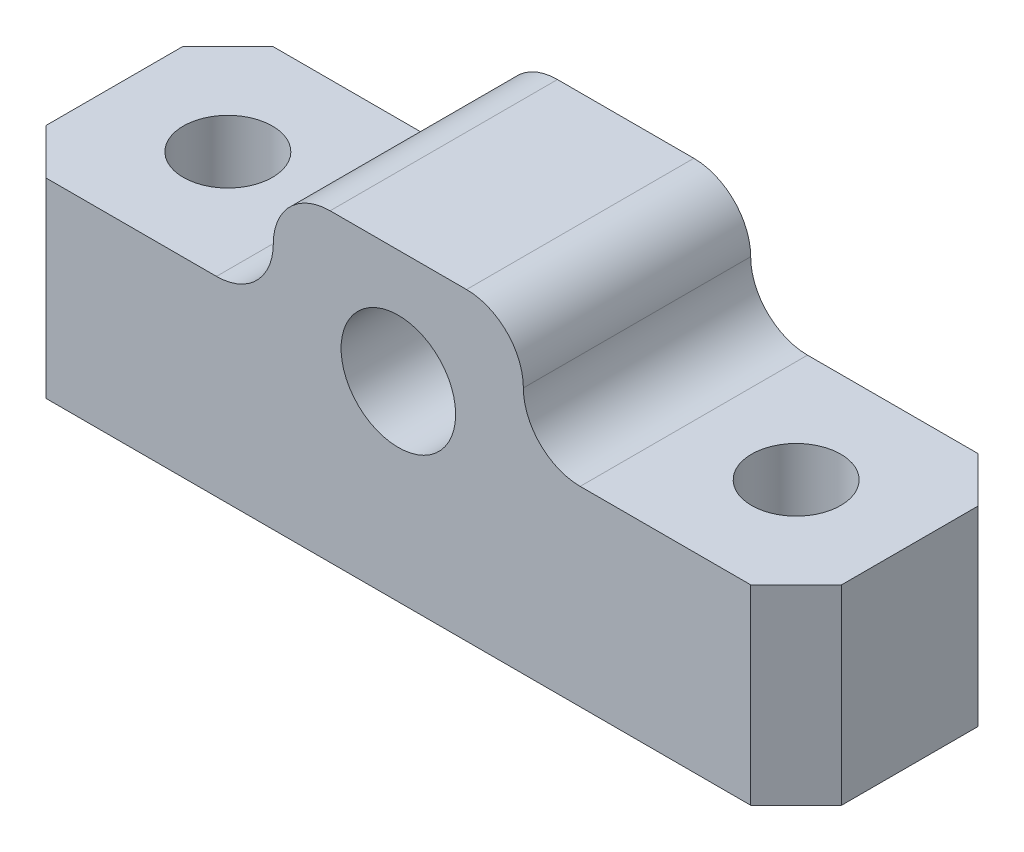
ISO-10303-21;
HEADER;
FILE_DESCRIPTION(('STEP AP214'),'2;1');
FILE_NAME('part.step','',(''),(''),'','','');
FILE_SCHEMA(('AUTOMOTIVE_DESIGN { 1 0 10303 214 1 1 1 1 }'));
ENDSEC;
DATA;
#1=APPLICATION_CONTEXT('core data for automotive mechanical design processes');
#2=APPLICATION_PROTOCOL_DEFINITION('international standard','automotive_design',2000,#1);
#3=PRODUCT_CONTEXT('',#1,'mechanical');
#4=PRODUCT('Part','Part','',(#3));
#5=PRODUCT_RELATED_PRODUCT_CATEGORY('part','',(#4));
#6=PRODUCT_DEFINITION_FORMATION('','',#4);
#7=PRODUCT_DEFINITION_CONTEXT('part definition',#1,'design');
#8=PRODUCT_DEFINITION('design','',#6,#7);
#9=PRODUCT_DEFINITION_SHAPE('','',#8);
#10=(LENGTH_UNIT() NAMED_UNIT(*) SI_UNIT(.MILLI.,.METRE.));
#11=(NAMED_UNIT(*) PLANE_ANGLE_UNIT() SI_UNIT($,.RADIAN.));
#12=(NAMED_UNIT(*) SI_UNIT($,.STERADIAN.) SOLID_ANGLE_UNIT());
#13=UNCERTAINTY_MEASURE_WITH_UNIT(LENGTH_MEASURE(1.E-05),#10,'distance_accuracy_value','');
#14=(GEOMETRIC_REPRESENTATION_CONTEXT(3) GLOBAL_UNCERTAINTY_ASSIGNED_CONTEXT((#13)) GLOBAL_UNIT_ASSIGNED_CONTEXT((#10,
#11,#12)) REPRESENTATION_CONTEXT('',''));
#15=CARTESIAN_POINT('',(0.,0.,0.));
#16=DIRECTION('',(0.,0.,1.));
#17=DIRECTION('',(1.,0.,0.));
#18=AXIS2_PLACEMENT_3D('',#15,#16,#17);
#19=CARTESIAN_POINT('',(-6.985,17.018,12.7));
#20=DIRECTION('',(0.,1.,0.));
#21=DIRECTION('',(0.,0.,1.));
#22=AXIS2_PLACEMENT_3D('',#19,#20,#21);
#23=PLANE('',#22);
#24=DIRECTION('',(1.,0.,0.));
#25=VECTOR('',#24,1.);
#26=CARTESIAN_POINT('',(-6.985,17.018,0.));
#27=LINE('',#26,#25);
#28=CARTESIAN_POINT('',(-3.81,17.018,0.));
#29=VERTEX_POINT('',#28);
#30=CARTESIAN_POINT('',(3.81,17.018,0.));
#31=VERTEX_POINT('',#30);
#32=EDGE_CURVE('E262',#29,#31,#27,.T.);
#33=ORIENTED_EDGE('',*,*,#32,.F.);
#34=DIRECTION('',(0.,0.,-1.));
#35=VECTOR('',#34,1.);
#36=CARTESIAN_POINT('',(-3.81,17.018,12.7));
#37=LINE('',#36,#35);
#38=CARTESIAN_POINT('',(-3.81,17.018,12.7));
#39=VERTEX_POINT('',#38);
#40=EDGE_CURVE('E210',#29,#39,#37,.F.);
#41=ORIENTED_EDGE('',*,*,#40,.T.);
#42=DIRECTION('',(1.,0.,0.));
#43=VECTOR('',#42,1.);
#44=CARTESIAN_POINT('',(-6.985,17.018,12.7));
#45=LINE('',#44,#43);
#46=CARTESIAN_POINT('',(3.81,17.018,12.7));
#47=VERTEX_POINT('',#46);
#48=EDGE_CURVE('E258',#39,#47,#45,.T.);
#49=ORIENTED_EDGE('',*,*,#48,.T.);
#50=DIRECTION('',(0.,0.,-1.));
#51=VECTOR('',#50,1.);
#52=CARTESIAN_POINT('',(3.81,17.018,12.7));
#53=LINE('',#52,#51);
#54=EDGE_CURVE('E207',#47,#31,#53,.T.);
#55=ORIENTED_EDGE('',*,*,#54,.T.);
#56=EDGE_LOOP('',(#33,#41,#49,#55));
#57=FACE_BOUND('',#56,.T.);
#58=ADVANCED_FACE('F39',(#57),#23,.T.);
#59=CARTESIAN_POINT('',(-22.225,10.668,12.7));
#60=DIRECTION('',(0.,1.,0.));
#61=DIRECTION('',(-1.,0.,0.));
#62=AXIS2_PLACEMENT_3D('',#59,#60,#61);
#63=PLANE('',#62);
#64=CARTESIAN_POINT('',(-15.875,10.668,6.35000000000022));
#65=DIRECTION('',(0.,1.,0.));
#66=DIRECTION('',(0.,0.,1.));
#67=AXIS2_PLACEMENT_3D('',#64,#65,#66);
#68=CIRCLE('',#67,2.48920000000001);
#69=CARTESIAN_POINT('',(-15.875,10.668,8.83920000000023));
#70=VERTEX_POINT('',#69);
#71=EDGE_CURVE('E284',#70,#70,#68,.T.);
#72=ORIENTED_EDGE('',*,*,#71,.F.);
#73=EDGE_LOOP('',(#72));
#74=FACE_BOUND('',#73,.T.);
#75=DIRECTION('',(1.,0.,0.));
#76=VECTOR('',#75,1.);
#77=CARTESIAN_POINT('',(-22.225,10.668,12.7));
#78=LINE('',#77,#76);
#79=CARTESIAN_POINT('',(-19.685,10.668,12.7));
#80=VERTEX_POINT('',#79);
#81=CARTESIAN_POINT('',(-10.16,10.668,12.7));
#82=VERTEX_POINT('',#81);
#83=EDGE_CURVE('E270',#80,#82,#78,.T.);
#84=ORIENTED_EDGE('',*,*,#83,.T.);
#85=DIRECTION('',(0.,0.,-1.));
#86=VECTOR('',#85,1.);
#87=CARTESIAN_POINT('',(-10.16,10.668,0.));
#88=LINE('',#87,#86);
#89=CARTESIAN_POINT('',(-10.16,10.668,0.));
#90=VERTEX_POINT('',#89);
#91=EDGE_CURVE('E200',#82,#90,#88,.T.);
#92=ORIENTED_EDGE('',*,*,#91,.T.);
#93=DIRECTION('',(1.,0.,0.));
#94=VECTOR('',#93,1.);
#95=CARTESIAN_POINT('',(-22.225,10.668,0.));
#96=LINE('',#95,#94);
#97=CARTESIAN_POINT('',(-19.685,10.668,0.));
#98=VERTEX_POINT('',#97);
#99=EDGE_CURVE('E252',#98,#90,#96,.T.);
#100=ORIENTED_EDGE('',*,*,#99,.F.);
#101=DIRECTION('',(-0.707106781186544,0.,0.707106781186551));
#102=VECTOR('',#101,1.);
#103=CARTESIAN_POINT('',(-27.305,10.668,7.62000000000005));
#104=LINE('',#103,#102);
#105=CARTESIAN_POINT('',(-22.225,10.668,2.54000000000001));
#106=VERTEX_POINT('',#105);
#107=EDGE_CURVE('E168',#98,#106,#104,.T.);
#108=ORIENTED_EDGE('',*,*,#107,.T.);
#109=DIRECTION('',(0.,0.,-1.));
#110=VECTOR('',#109,1.);
#111=CARTESIAN_POINT('',(-22.225,10.668,12.7));
#112=LINE('',#111,#110);
#113=CARTESIAN_POINT('',(-22.225,10.668,10.16));
#114=VERTEX_POINT('',#113);
#115=EDGE_CURVE('E163',#114,#106,#112,.T.);
#116=ORIENTED_EDGE('',*,*,#115,.F.);
#117=DIRECTION('',(-0.707106781186549,0.,-0.707106781186546));
#118=VECTOR('',#117,1.);
#119=CARTESIAN_POINT('',(-20.955,10.668,11.43));
#120=LINE('',#119,#118);
#121=EDGE_CURVE('E167',#114,#80,#120,.F.);
#122=ORIENTED_EDGE('',*,*,#121,.T.);
#123=EDGE_LOOP('',(#84,#92,#100,#108,#116,#122));
#124=FACE_BOUND('',#123,.T.);
#125=ADVANCED_FACE('F322',(#74,#124),#63,.T.);
#126=CARTESIAN_POINT('',(-22.225,0.,12.7));
#127=DIRECTION('',(-1.,0.,0.));
#128=DIRECTION('',(0.,-1.,0.));
#129=AXIS2_PLACEMENT_3D('',#126,#127,#128);
#130=PLANE('',#129);
#131=DIRECTION('',(0.,0.,-1.));
#132=VECTOR('',#131,1.);
#133=CARTESIAN_POINT('',(-22.225,0.,12.7));
#134=LINE('',#133,#132);
#135=CARTESIAN_POINT('',(-22.225,0.,10.16));
#136=VERTEX_POINT('',#135);
#137=CARTESIAN_POINT('',(-22.225,0.,2.54000000000001));
#138=VERTEX_POINT('',#137);
#139=EDGE_CURVE('E145',#136,#138,#134,.T.);
#140=ORIENTED_EDGE('',*,*,#139,.F.);
#141=DIRECTION('',(0.,1.,0.));
#142=VECTOR('',#141,1.);
#143=CARTESIAN_POINT('',(-22.225,0.,10.16));
#144=LINE('',#143,#142);
#145=EDGE_CURVE('E159',#136,#114,#144,.T.);
#146=ORIENTED_EDGE('',*,*,#145,.T.);
#147=ORIENTED_EDGE('',*,*,#115,.T.);
#148=DIRECTION('',(0.,-1.,0.));
#149=VECTOR('',#148,1.);
#150=CARTESIAN_POINT('',(-22.225,0.,2.54000000000001));
#151=LINE('',#150,#149);
#152=EDGE_CURVE('E162',#106,#138,#151,.T.);
#153=ORIENTED_EDGE('',*,*,#152,.T.);
#154=EDGE_LOOP('',(#140,#146,#147,#153));
#155=FACE_BOUND('',#154,.T.);
#156=ADVANCED_FACE('F157',(#155),#130,.T.);
#157=CARTESIAN_POINT('',(22.225,0.,12.7));
#158=DIRECTION('',(0.,-1.,0.));
#159=DIRECTION('',(0.,0.,-1.));
#160=AXIS2_PLACEMENT_3D('',#157,#158,#159);
#161=PLANE('',#160);
#162=CARTESIAN_POINT('',(-15.875,0.,6.35000000000022));
#163=DIRECTION('',(0.,1.,0.));
#164=DIRECTION('',(0.,0.,1.));
#165=AXIS2_PLACEMENT_3D('',#162,#163,#164);
#166=CIRCLE('',#165,2.48920000000001);
#167=CARTESIAN_POINT('',(-15.875,0.,8.83920000000023));
#168=VERTEX_POINT('',#167);
#169=EDGE_CURVE('E281',#168,#168,#166,.T.);
#170=ORIENTED_EDGE('',*,*,#169,.T.);
#171=EDGE_LOOP('',(#170));
#172=FACE_BOUND('',#171,.T.);
#173=CARTESIAN_POINT('',(15.875,0.,6.34999999999978));
#174=DIRECTION('',(0.,1.,0.));
#175=DIRECTION('',(0.,0.,1.));
#176=AXIS2_PLACEMENT_3D('',#173,#174,#175);
#177=CIRCLE('',#176,2.48920000000001);
#178=CARTESIAN_POINT('',(15.875,0.,8.83919999999979));
#179=VERTEX_POINT('',#178);
#180=EDGE_CURVE('E249',#179,#179,#177,.T.);
#181=ORIENTED_EDGE('',*,*,#180,.T.);
#182=EDGE_LOOP('',(#181));
#183=FACE_BOUND('',#182,.T.);
#184=DIRECTION('',(-1.,0.,0.));
#185=VECTOR('',#184,1.);
#186=CARTESIAN_POINT('',(22.225,0.,12.7));
#187=LINE('',#186,#185);
#188=CARTESIAN_POINT('',(19.685,0.,12.7));
#189=VERTEX_POINT('',#188);
#190=CARTESIAN_POINT('',(-19.685,0.,12.7));
#191=VERTEX_POINT('',#190);
#192=EDGE_CURVE('E148',#189,#191,#187,.T.);
#193=ORIENTED_EDGE('',*,*,#192,.T.);
#194=DIRECTION('',(0.707106781186549,0.,0.707106781186546));
#195=VECTOR('',#194,1.);
#196=CARTESIAN_POINT('',(1.27000000000005,0.,33.655));
#197=LINE('',#196,#195);
#198=EDGE_CURVE('E142',#191,#136,#197,.F.);
#199=ORIENTED_EDGE('',*,*,#198,.T.);
#200=ORIENTED_EDGE('',*,*,#139,.T.);
#201=DIRECTION('',(0.707106781186544,0.,-0.707106781186551));
#202=VECTOR('',#201,1.);
#203=CARTESIAN_POINT('',(-5.08000000000024,0.,-14.605));
#204=LINE('',#203,#202);
#205=CARTESIAN_POINT('',(-19.685,0.,0.));
#206=VERTEX_POINT('',#205);
#207=EDGE_CURVE('E180',#138,#206,#204,.T.);
#208=ORIENTED_EDGE('',*,*,#207,.T.);
#209=DIRECTION('',(-1.,0.,0.));
#210=VECTOR('',#209,1.);
#211=CARTESIAN_POINT('',(22.225,0.,0.));
#212=LINE('',#211,#210);
#213=CARTESIAN_POINT('',(19.685,0.,0.));
#214=VERTEX_POINT('',#213);
#215=EDGE_CURVE('E248',#214,#206,#212,.T.);
#216=ORIENTED_EDGE('',*,*,#215,.F.);
#217=DIRECTION('',(0.707106781186545,0.,0.70710678118655));
#218=VECTOR('',#217,1.);
#219=CARTESIAN_POINT('',(27.305,0.,7.62000000000005));
#220=LINE('',#219,#218);
#221=CARTESIAN_POINT('',(22.225,0.,2.54000000000001));
#222=VERTEX_POINT('',#221);
#223=EDGE_CURVE('E153',#214,#222,#220,.T.);
#224=ORIENTED_EDGE('',*,*,#223,.T.);
#225=DIRECTION('',(0.,0.,-1.));
#226=VECTOR('',#225,1.);
#227=CARTESIAN_POINT('',(22.225,0.,12.7));
#228=LINE('',#227,#226);
#229=CARTESIAN_POINT('',(22.225,0.,10.16));
#230=VERTEX_POINT('',#229);
#231=EDGE_CURVE('E164',#230,#222,#228,.T.);
#232=ORIENTED_EDGE('',*,*,#231,.F.);
#233=DIRECTION('',(0.707106781186549,0.,-0.707106781186546));
#234=VECTOR('',#233,1.);
#235=CARTESIAN_POINT('',(20.955,0.,11.43));
#236=LINE('',#235,#234);
#237=EDGE_CURVE('E182',#230,#189,#236,.F.);
#238=ORIENTED_EDGE('',*,*,#237,.T.);
#239=EDGE_LOOP('',(#193,#199,#200,#208,#216,#224,#232,#238));
#240=FACE_BOUND('',#239,.T.);
#241=ADVANCED_FACE('F144',(#172,#183,#240),#161,.T.);
#242=CARTESIAN_POINT('',(22.225,10.668,12.7));
#243=DIRECTION('',(1.,0.,0.));
#244=DIRECTION('',(0.,1.,0.));
#245=AXIS2_PLACEMENT_3D('',#242,#243,#244);
#246=PLANE('',#245);
#247=ORIENTED_EDGE('',*,*,#231,.T.);
#248=DIRECTION('',(0.,1.,0.));
#249=VECTOR('',#248,1.);
#250=CARTESIAN_POINT('',(22.225,10.668,2.54000000000001));
#251=LINE('',#250,#249);
#252=CARTESIAN_POINT('',(22.225,10.668,2.54000000000001));
#253=VERTEX_POINT('',#252);
#254=EDGE_CURVE('E193',#222,#253,#251,.T.);
#255=ORIENTED_EDGE('',*,*,#254,.T.);
#256=DIRECTION('',(0.,0.,-1.));
#257=VECTOR('',#256,1.);
#258=CARTESIAN_POINT('',(22.225,10.668,12.7));
#259=LINE('',#258,#257);
#260=CARTESIAN_POINT('',(22.225,10.668,10.16));
#261=VERTEX_POINT('',#260);
#262=EDGE_CURVE('E267',#261,#253,#259,.T.);
#263=ORIENTED_EDGE('',*,*,#262,.F.);
#264=DIRECTION('',(0.,-1.,0.));
#265=VECTOR('',#264,1.);
#266=CARTESIAN_POINT('',(22.225,10.668,10.16));
#267=LINE('',#266,#265);
#268=EDGE_CURVE('E190',#261,#230,#267,.T.);
#269=ORIENTED_EDGE('',*,*,#268,.T.);
#270=EDGE_LOOP('',(#247,#255,#263,#269));
#271=FACE_BOUND('',#270,.T.);
#272=ADVANCED_FACE('F312',(#271),#246,.T.);
#273=CARTESIAN_POINT('',(6.985,10.668,12.7));
#274=DIRECTION('',(0.,1.,0.));
#275=DIRECTION('',(-1.,0.,0.));
#276=AXIS2_PLACEMENT_3D('',#273,#274,#275);
#277=PLANE('',#276);
#278=CARTESIAN_POINT('',(15.875,10.668,6.34999999999978));
#279=DIRECTION('',(0.,1.,0.));
#280=DIRECTION('',(0.,0.,1.));
#281=AXIS2_PLACEMENT_3D('',#278,#279,#280);
#282=CIRCLE('',#281,2.48920000000001);
#283=CARTESIAN_POINT('',(15.875,10.668,8.83919999999979));
#284=VERTEX_POINT('',#283);
#285=EDGE_CURVE('E255',#284,#284,#282,.T.);
#286=ORIENTED_EDGE('',*,*,#285,.F.);
#287=EDGE_LOOP('',(#286));
#288=FACE_BOUND('',#287,.T.);
#289=DIRECTION('',(1.,0.,0.));
#290=VECTOR('',#289,1.);
#291=CARTESIAN_POINT('',(6.985,10.668,0.));
#292=LINE('',#291,#290);
#293=CARTESIAN_POINT('',(10.16,10.668,0.));
#294=VERTEX_POINT('',#293);
#295=CARTESIAN_POINT('',(19.685,10.668,0.));
#296=VERTEX_POINT('',#295);
#297=EDGE_CURVE('E241',#294,#296,#292,.T.);
#298=ORIENTED_EDGE('',*,*,#297,.F.);
#299=DIRECTION('',(0.,0.,-1.));
#300=VECTOR('',#299,1.);
#301=CARTESIAN_POINT('',(10.16,10.668,12.7));
#302=LINE('',#301,#300);
#303=CARTESIAN_POINT('',(10.16,10.668,12.7));
#304=VERTEX_POINT('',#303);
#305=EDGE_CURVE('E215',#294,#304,#302,.F.);
#306=ORIENTED_EDGE('',*,*,#305,.T.);
#307=DIRECTION('',(1.,0.,0.));
#308=VECTOR('',#307,1.);
#309=CARTESIAN_POINT('',(6.985,10.668,12.7));
#310=LINE('',#309,#308);
#311=CARTESIAN_POINT('',(19.685,10.668,12.7));
#312=VERTEX_POINT('',#311);
#313=EDGE_CURVE('E264',#304,#312,#310,.T.);
#314=ORIENTED_EDGE('',*,*,#313,.T.);
#315=DIRECTION('',(-0.707106781186549,0.,0.707106781186546));
#316=VECTOR('',#315,1.);
#317=CARTESIAN_POINT('',(13.335,10.668,19.05));
#318=LINE('',#317,#316);
#319=EDGE_CURVE('E195',#312,#261,#318,.F.);
#320=ORIENTED_EDGE('',*,*,#319,.T.);
#321=ORIENTED_EDGE('',*,*,#262,.T.);
#322=DIRECTION('',(-0.707106781186545,0.,-0.70710678118655));
#323=VECTOR('',#322,1.);
#324=CARTESIAN_POINT('',(19.6850000000001,10.668,0.));
#325=LINE('',#324,#323);
#326=EDGE_CURVE('E197',#253,#296,#325,.T.);
#327=ORIENTED_EDGE('',*,*,#326,.T.);
#328=EDGE_LOOP('',(#298,#306,#314,#320,#321,#327));
#329=FACE_BOUND('',#328,.T.);
#330=ADVANCED_FACE('F244',(#288,#329),#277,.T.);
#331=CARTESIAN_POINT('',(0.,0.,12.7));
#332=DIRECTION('',(0.,0.,1.));
#333=DIRECTION('',(1.,0.,0.));
#334=AXIS2_PLACEMENT_3D('',#331,#332,#333);
#335=PLANE('',#334);
#336=CARTESIAN_POINT('',(0.,10.668,12.7));
#337=DIRECTION('',(0.,0.,1.));
#338=DIRECTION('',(1.,0.,0.));
#339=AXIS2_PLACEMENT_3D('',#336,#337,#338);
#340=CIRCLE('',#339,3.19999999999999);
#341=CARTESIAN_POINT('',(3.19999999999999,10.668,12.7));
#342=VERTEX_POINT('',#341);
#343=EDGE_CURVE('E223',#342,#342,#340,.T.);
#344=ORIENTED_EDGE('',*,*,#343,.F.);
#345=EDGE_LOOP('',(#344));
#346=FACE_BOUND('',#345,.T.);
#347=ORIENTED_EDGE('',*,*,#48,.F.);
#348=CARTESIAN_POINT('',(-3.81,13.843,12.7));
#349=DIRECTION('',(0.,0.,1.));
#350=DIRECTION('',(1.,0.,0.));
#351=AXIS2_PLACEMENT_3D('',#348,#349,#350);
#352=CIRCLE('',#351,3.175);
#353=CARTESIAN_POINT('',(-6.985,13.843,12.7));
#354=VERTEX_POINT('',#353);
#355=EDGE_CURVE('E56',#39,#354,#352,.T.);
#356=ORIENTED_EDGE('',*,*,#355,.T.);
#357=CARTESIAN_POINT('',(-10.16,13.843,12.7));
#358=DIRECTION('',(0.,0.,1.));
#359=DIRECTION('',(1.,0.,0.));
#360=AXIS2_PLACEMENT_3D('',#357,#358,#359);
#361=CIRCLE('',#360,3.175);
#362=EDGE_CURVE('E219',#354,#82,#361,.F.);
#363=ORIENTED_EDGE('',*,*,#362,.T.);
#364=ORIENTED_EDGE('',*,*,#83,.F.);
#365=DIRECTION('',(0.,-1.,0.));
#366=VECTOR('',#365,1.);
#367=CARTESIAN_POINT('',(-19.685,0.,12.7));
#368=LINE('',#367,#366);
#369=EDGE_CURVE('E178',#80,#191,#368,.T.);
#370=ORIENTED_EDGE('',*,*,#369,.T.);
#371=ORIENTED_EDGE('',*,*,#192,.F.);
#372=DIRECTION('',(0.,1.,0.));
#373=VECTOR('',#372,1.);
#374=CARTESIAN_POINT('',(19.685,0.,12.7));
#375=LINE('',#374,#373);
#376=EDGE_CURVE('E175',#189,#312,#375,.T.);
#377=ORIENTED_EDGE('',*,*,#376,.T.);
#378=ORIENTED_EDGE('',*,*,#313,.F.);
#379=CARTESIAN_POINT('',(10.16,13.843,12.7));
#380=DIRECTION('',(0.,0.,1.));
#381=DIRECTION('',(1.,0.,0.));
#382=AXIS2_PLACEMENT_3D('',#379,#380,#381);
#383=CIRCLE('',#382,3.175);
#384=CARTESIAN_POINT('',(6.985,13.843,12.7));
#385=VERTEX_POINT('',#384);
#386=EDGE_CURVE('E11',#304,#385,#383,.F.);
#387=ORIENTED_EDGE('',*,*,#386,.T.);
#388=CARTESIAN_POINT('',(3.81,13.843,12.7));
#389=DIRECTION('',(0.,0.,1.));
#390=DIRECTION('',(1.,0.,0.));
#391=AXIS2_PLACEMENT_3D('',#388,#389,#390);
#392=CIRCLE('',#391,3.175);
#393=EDGE_CURVE('E212',#385,#47,#392,.T.);
#394=ORIENTED_EDGE('',*,*,#393,.T.);
#395=EDGE_LOOP('',(#347,#356,#363,#364,#370,#371,#377,#378,#387,#394));
#396=FACE_BOUND('',#395,.T.);
#397=ADVANCED_FACE('F299',(#346,#396),#335,.T.);
#398=CARTESIAN_POINT('',(0.,0.,0.));
#399=DIRECTION('',(0.,0.,1.));
#400=DIRECTION('',(1.,0.,0.));
#401=AXIS2_PLACEMENT_3D('',#398,#399,#400);
#402=PLANE('',#401);
#403=CARTESIAN_POINT('',(0.,10.668,0.));
#404=DIRECTION('',(0.,0.,1.));
#405=DIRECTION('',(1.,0.,0.));
#406=AXIS2_PLACEMENT_3D('',#403,#404,#405);
#407=CIRCLE('',#406,3.19999999999999);
#408=CARTESIAN_POINT('',(3.19999999999999,10.668,0.));
#409=VERTEX_POINT('',#408);
#410=EDGE_CURVE('E227',#409,#409,#407,.T.);
#411=ORIENTED_EDGE('',*,*,#410,.T.);
#412=EDGE_LOOP('',(#411));
#413=FACE_BOUND('',#412,.T.);
#414=ORIENTED_EDGE('',*,*,#99,.T.);
#415=CARTESIAN_POINT('',(-10.16,13.843,0.));
#416=DIRECTION('',(0.,0.,1.));
#417=DIRECTION('',(1.,0.,0.));
#418=AXIS2_PLACEMENT_3D('',#415,#416,#417);
#419=CIRCLE('',#418,3.175);
#420=CARTESIAN_POINT('',(-6.985,13.843,0.));
#421=VERTEX_POINT('',#420);
#422=EDGE_CURVE('E217',#90,#421,#419,.T.);
#423=ORIENTED_EDGE('',*,*,#422,.T.);
#424=CARTESIAN_POINT('',(-3.81,13.843,0.));
#425=DIRECTION('',(0.,0.,1.));
#426=DIRECTION('',(1.,0.,0.));
#427=AXIS2_PLACEMENT_3D('',#424,#425,#426);
#428=CIRCLE('',#427,3.175);
#429=EDGE_CURVE('E205',#421,#29,#428,.F.);
#430=ORIENTED_EDGE('',*,*,#429,.T.);
#431=ORIENTED_EDGE('',*,*,#32,.T.);
#432=CARTESIAN_POINT('',(3.81,13.843,0.));
#433=DIRECTION('',(0.,0.,1.));
#434=DIRECTION('',(1.,0.,0.));
#435=AXIS2_PLACEMENT_3D('',#432,#433,#434);
#436=CIRCLE('',#435,3.175);
#437=CARTESIAN_POINT('',(6.985,13.843,0.));
#438=VERTEX_POINT('',#437);
#439=EDGE_CURVE('E203',#31,#438,#436,.F.);
#440=ORIENTED_EDGE('',*,*,#439,.T.);
#441=CARTESIAN_POINT('',(10.16,13.843,0.));
#442=DIRECTION('',(0.,0.,1.));
#443=DIRECTION('',(1.,0.,0.));
#444=AXIS2_PLACEMENT_3D('',#441,#442,#443);
#445=CIRCLE('',#444,3.175);
#446=EDGE_CURVE('E48',#438,#294,#445,.T.);
#447=ORIENTED_EDGE('',*,*,#446,.T.);
#448=ORIENTED_EDGE('',*,*,#297,.T.);
#449=DIRECTION('',(0.,-1.,0.));
#450=VECTOR('',#449,1.);
#451=CARTESIAN_POINT('',(19.685,0.,0.));
#452=LINE('',#451,#450);
#453=EDGE_CURVE('E187',#296,#214,#452,.T.);
#454=ORIENTED_EDGE('',*,*,#453,.T.);
#455=ORIENTED_EDGE('',*,*,#215,.T.);
#456=DIRECTION('',(0.,1.,0.));
#457=VECTOR('',#456,1.);
#458=CARTESIAN_POINT('',(-19.685,10.668,0.));
#459=LINE('',#458,#457);
#460=EDGE_CURVE('E152',#206,#98,#459,.T.);
#461=ORIENTED_EDGE('',*,*,#460,.T.);
#462=EDGE_LOOP('',(#414,#423,#430,#431,#440,#447,#448,#454,#455,#461));
#463=FACE_BOUND('',#462,.T.);
#464=ADVANCED_FACE('F240',(#413,#463),#402,.F.);
#465=CARTESIAN_POINT('',(-22.225,0.,10.16));
#466=DIRECTION('',(0.707106781186546,0.,-0.707106781186549));
#467=DIRECTION('',(0.,1.,0.));
#468=AXIS2_PLACEMENT_3D('',#465,#466,#467);
#469=PLANE('',#468);
#470=ORIENTED_EDGE('',*,*,#198,.F.);
#471=ORIENTED_EDGE('',*,*,#369,.F.);
#472=ORIENTED_EDGE('',*,*,#121,.F.);
#473=ORIENTED_EDGE('',*,*,#145,.F.);
#474=EDGE_LOOP('',(#470,#471,#472,#473));
#475=FACE_BOUND('',#474,.T.);
#476=ADVANCED_FACE('F166',(#475),#469,.F.);
#477=CARTESIAN_POINT('',(19.685,0.,0.));
#478=DIRECTION('',(0.70710678118655,0.,-0.707106781186545));
#479=DIRECTION('',(0.,1.,0.));
#480=AXIS2_PLACEMENT_3D('',#477,#478,#479);
#481=PLANE('',#480);
#482=ORIENTED_EDGE('',*,*,#326,.F.);
#483=ORIENTED_EDGE('',*,*,#254,.F.);
#484=ORIENTED_EDGE('',*,*,#223,.F.);
#485=ORIENTED_EDGE('',*,*,#453,.F.);
#486=EDGE_LOOP('',(#482,#483,#484,#485));
#487=FACE_BOUND('',#486,.T.);
#488=ADVANCED_FACE('F316',(#487),#481,.T.);
#489=CARTESIAN_POINT('',(22.225,10.668,10.16));
#490=DIRECTION('',(-0.707106781186546,0.,-0.707106781186549));
#491=DIRECTION('',(0.,-1.,0.));
#492=AXIS2_PLACEMENT_3D('',#489,#490,#491);
#493=PLANE('',#492);
#494=ORIENTED_EDGE('',*,*,#319,.F.);
#495=ORIENTED_EDGE('',*,*,#376,.F.);
#496=ORIENTED_EDGE('',*,*,#237,.F.);
#497=ORIENTED_EDGE('',*,*,#268,.F.);
#498=EDGE_LOOP('',(#494,#495,#496,#497));
#499=FACE_BOUND('',#498,.T.);
#500=ADVANCED_FACE('F309',(#499),#493,.F.);
#501=CARTESIAN_POINT('',(-19.6850000000001,0.,0.));
#502=DIRECTION('',(-0.707106781186551,0.,-0.707106781186544));
#503=DIRECTION('',(0.,-1.,0.));
#504=AXIS2_PLACEMENT_3D('',#501,#502,#503);
#505=PLANE('',#504);
#506=ORIENTED_EDGE('',*,*,#207,.F.);
#507=ORIENTED_EDGE('',*,*,#152,.F.);
#508=ORIENTED_EDGE('',*,*,#107,.F.);
#509=ORIENTED_EDGE('',*,*,#460,.F.);
#510=EDGE_LOOP('',(#506,#507,#508,#509));
#511=FACE_BOUND('',#510,.T.);
#512=ADVANCED_FACE('F320',(#511),#505,.T.);
#513=CARTESIAN_POINT('',(15.875,10.668,6.34999999999978));
#514=DIRECTION('',(0.,1.,0.));
#515=DIRECTION('',(0.,0.,1.));
#516=AXIS2_PLACEMENT_3D('',#513,#514,#515);
#517=CYLINDRICAL_SURFACE('',#516,2.48920000000001);
#518=ORIENTED_EDGE('',*,*,#180,.F.);
#519=EDGE_LOOP('',(#518));
#520=FACE_BOUND('',#519,.T.);
#521=ORIENTED_EDGE('',*,*,#285,.T.);
#522=EDGE_LOOP('',(#521));
#523=FACE_BOUND('',#522,.T.);
#524=ADVANCED_FACE('F363',(#520,#523),#517,.F.);
#525=CARTESIAN_POINT('',(-15.875,10.668,6.35000000000022));
#526=DIRECTION('',(0.,1.,0.));
#527=DIRECTION('',(0.,0.,1.));
#528=AXIS2_PLACEMENT_3D('',#525,#526,#527);
#529=CYLINDRICAL_SURFACE('',#528,2.48920000000001);
#530=ORIENTED_EDGE('',*,*,#169,.F.);
#531=EDGE_LOOP('',(#530));
#532=FACE_BOUND('',#531,.T.);
#533=ORIENTED_EDGE('',*,*,#71,.T.);
#534=EDGE_LOOP('',(#533));
#535=FACE_BOUND('',#534,.T.);
#536=ADVANCED_FACE('F295',(#532,#535),#529,.F.);
#537=CARTESIAN_POINT('',(0.,10.668,12.7));
#538=DIRECTION('',(0.,0.,1.));
#539=DIRECTION('',(1.,0.,0.));
#540=AXIS2_PLACEMENT_3D('',#537,#538,#539);
#541=CYLINDRICAL_SURFACE('',#540,3.19999999999999);
#542=ORIENTED_EDGE('',*,*,#410,.F.);
#543=EDGE_LOOP('',(#542));
#544=FACE_BOUND('',#543,.T.);
#545=ORIENTED_EDGE('',*,*,#343,.T.);
#546=EDGE_LOOP('',(#545));
#547=FACE_BOUND('',#546,.T.);
#548=ADVANCED_FACE('F291',(#544,#547),#541,.F.);
#549=CARTESIAN_POINT('',(-3.81,13.843,12.7));
#550=DIRECTION('',(0.,0.,-1.));
#551=DIRECTION('',(-1.,0.,0.));
#552=AXIS2_PLACEMENT_3D('',#549,#550,#551);
#553=CYLINDRICAL_SURFACE('',#552,3.175);
#554=DIRECTION('',(0.,0.,-1.));
#555=VECTOR('',#554,1.);
#556=CARTESIAN_POINT('',(-6.985,13.843,12.7));
#557=LINE('',#556,#555);
#558=EDGE_CURVE('E221',#354,#421,#557,.T.);
#559=ORIENTED_EDGE('',*,*,#558,.F.);
#560=ORIENTED_EDGE('',*,*,#355,.F.);
#561=ORIENTED_EDGE('',*,*,#40,.F.);
#562=ORIENTED_EDGE('',*,*,#429,.F.);
#563=EDGE_LOOP('',(#559,#560,#561,#562));
#564=FACE_BOUND('',#563,.T.);
#565=ADVANCED_FACE('F294',(#564),#553,.T.);
#566=CARTESIAN_POINT('',(-10.16,13.843,12.7));
#567=DIRECTION('',(0.,0.,1.));
#568=DIRECTION('',(1.,0.,0.));
#569=AXIS2_PLACEMENT_3D('',#566,#567,#568);
#570=CYLINDRICAL_SURFACE('',#569,3.175);
#571=ORIENTED_EDGE('',*,*,#362,.F.);
#572=ORIENTED_EDGE('',*,*,#558,.T.);
#573=ORIENTED_EDGE('',*,*,#422,.F.);
#574=ORIENTED_EDGE('',*,*,#91,.F.);
#575=EDGE_LOOP('',(#571,#572,#573,#574));
#576=FACE_BOUND('',#575,.T.);
#577=ADVANCED_FACE('F305',(#576),#570,.F.);
#578=CARTESIAN_POINT('',(10.16,13.843,12.7));
#579=DIRECTION('',(0.,0.,1.));
#580=DIRECTION('',(1.,0.,0.));
#581=AXIS2_PLACEMENT_3D('',#578,#579,#580);
#582=CYLINDRICAL_SURFACE('',#581,3.175);
#583=DIRECTION('',(0.,0.,-1.));
#584=VECTOR('',#583,1.);
#585=CARTESIAN_POINT('',(6.985,13.843,0.));
#586=LINE('',#585,#584);
#587=EDGE_CURVE('E43',#385,#438,#586,.T.);
#588=ORIENTED_EDGE('',*,*,#587,.F.);
#589=ORIENTED_EDGE('',*,*,#386,.F.);
#590=ORIENTED_EDGE('',*,*,#305,.F.);
#591=ORIENTED_EDGE('',*,*,#446,.F.);
#592=EDGE_LOOP('',(#588,#589,#590,#591));
#593=FACE_BOUND('',#592,.T.);
#594=ADVANCED_FACE('F41',(#593),#582,.F.);
#595=CARTESIAN_POINT('',(3.81,13.843,12.7));
#596=DIRECTION('',(0.,0.,-1.));
#597=DIRECTION('',(-1.,0.,0.));
#598=AXIS2_PLACEMENT_3D('',#595,#596,#597);
#599=CYLINDRICAL_SURFACE('',#598,3.175);
#600=ORIENTED_EDGE('',*,*,#393,.F.);
#601=ORIENTED_EDGE('',*,*,#587,.T.);
#602=ORIENTED_EDGE('',*,*,#439,.F.);
#603=ORIENTED_EDGE('',*,*,#54,.F.);
#604=EDGE_LOOP('',(#600,#601,#602,#603));
#605=FACE_BOUND('',#604,.T.);
#606=ADVANCED_FACE('F232',(#605),#599,.T.);
#607=CLOSED_SHELL('',(#58,#125,#156,#241,#272,#330,#397,#464,#476,#488,#500,#512,#524,#536,#548,
#565,#577,#594,#606));
#608=MANIFOLD_SOLID_BREP('B2',#607);
#609=ADVANCED_BREP_SHAPE_REPRESENTATION('',(#18,#608),#14);
#610=SHAPE_DEFINITION_REPRESENTATION(#9,#609);
ENDSEC;
END-ISO-10303-21;
